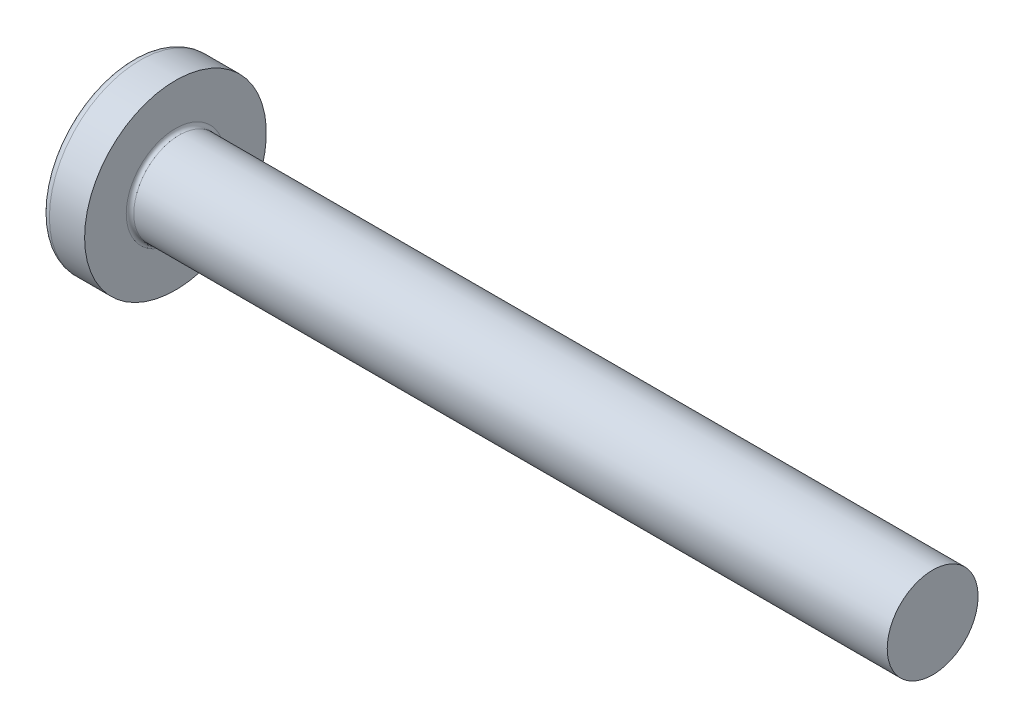
ISO-10303-21;
HEADER;
FILE_DESCRIPTION(('STEP AP214'),'2;1');
FILE_NAME('part.step','',(''),(''),'','','');
FILE_SCHEMA(('AUTOMOTIVE_DESIGN { 1 0 10303 214 1 1 1 1 }'));
ENDSEC;
DATA;
#1=APPLICATION_CONTEXT('core data for automotive mechanical design processes');
#2=APPLICATION_PROTOCOL_DEFINITION('international standard','automotive_design',2000,#1);
#3=PRODUCT_CONTEXT('',#1,'mechanical');
#4=PRODUCT('Part','Part','',(#3));
#5=PRODUCT_RELATED_PRODUCT_CATEGORY('part','',(#4));
#6=PRODUCT_DEFINITION_FORMATION('','',#4);
#7=PRODUCT_DEFINITION_CONTEXT('part definition',#1,'design');
#8=PRODUCT_DEFINITION('design','',#6,#7);
#9=PRODUCT_DEFINITION_SHAPE('','',#8);
#10=(LENGTH_UNIT() NAMED_UNIT(*) SI_UNIT(.MILLI.,.METRE.));
#11=(NAMED_UNIT(*) PLANE_ANGLE_UNIT() SI_UNIT($,.RADIAN.));
#12=(NAMED_UNIT(*) SI_UNIT($,.STERADIAN.) SOLID_ANGLE_UNIT());
#13=UNCERTAINTY_MEASURE_WITH_UNIT(LENGTH_MEASURE(1.E-05),#10,'distance_accuracy_value','');
#14=(GEOMETRIC_REPRESENTATION_CONTEXT(3) GLOBAL_UNCERTAINTY_ASSIGNED_CONTEXT((#13)) GLOBAL_UNIT_ASSIGNED_CONTEXT((#10,
#11,#12)) REPRESENTATION_CONTEXT('',''));
#15=CARTESIAN_POINT('',(0.,0.,0.));
#16=DIRECTION('',(0.,0.,1.));
#17=DIRECTION('',(1.,0.,0.));
#18=AXIS2_PLACEMENT_3D('',#15,#16,#17);
#19=CARTESIAN_POINT('',(3.46000000000024,0.,0.));
#20=DIRECTION('',(-1.,0.,0.));
#21=DIRECTION('',(0.,0.,1.));
#22=AXIS2_PLACEMENT_3D('',#19,#20,#21);
#23=CONICAL_SURFACE('',#22,1.28049999999957,1.25663706143548);
#24=CARTESIAN_POINT('',(3.8760596710265,0.,-3.33066907387547E-12));
#25=VERTEX_POINT('',#24);
#26=VERTEX_LOOP('',#25);
#27=FACE_BOUND('',#26,.T.);
#28=CARTESIAN_POINT('',(3.46000000000024,0.,0.));
#29=DIRECTION('',(-1.,0.,0.));
#30=DIRECTION('',(0.,0.,1.));
#31=AXIS2_PLACEMENT_3D('',#28,#29,#30);
#32=CIRCLE('',#31,1.28049999999957);
#33=CARTESIAN_POINT('',(3.46000000000017,-0.709999999999996,-1.06563607765555));
#34=VERTEX_POINT('',#33);
#35=CARTESIAN_POINT('',(3.46000000000012,0.710000000000004,-1.06563607765555));
#36=VERTEX_POINT('',#35);
#37=EDGE_CURVE('E142',#34,#36,#32,.F.);
#38=ORIENTED_EDGE('',*,*,#37,.F.);
#39=CARTESIAN_POINT('',(3.46000000000013,0.,0.));
#40=DIRECTION('',(-1.,0.,0.));
#41=DIRECTION('',(0.,0.,1.));
#42=AXIS2_PLACEMENT_3D('',#39,#40,#41);
#43=CIRCLE('',#42,1.28049999999957);
#44=CARTESIAN_POINT('',(3.46000000000012,-1.06563607765555,-0.710000000000001));
#45=VERTEX_POINT('',#44);
#46=EDGE_CURVE('E145',#45,#34,#43,.F.);
#47=ORIENTED_EDGE('',*,*,#46,.F.);
#48=CARTESIAN_POINT('',(3.46000000000024,0.,0.));
#49=DIRECTION('',(-1.,0.,0.));
#50=DIRECTION('',(0.,0.,1.));
#51=AXIS2_PLACEMENT_3D('',#48,#49,#50);
#52=CIRCLE('',#51,1.28049999999957);
#53=CARTESIAN_POINT('',(3.46000000000017,-1.06563607765554,0.71));
#54=VERTEX_POINT('',#53);
#55=EDGE_CURVE('E403',#54,#45,#52,.F.);
#56=ORIENTED_EDGE('',*,*,#55,.F.);
#57=CARTESIAN_POINT('',(3.46000000000013,0.,0.));
#58=DIRECTION('',(-1.,0.,0.));
#59=DIRECTION('',(0.,0.,1.));
#60=AXIS2_PLACEMENT_3D('',#57,#58,#59);
#61=CIRCLE('',#60,1.28049999999957);
#62=CARTESIAN_POINT('',(3.46000000000012,-0.710000000000004,1.06563607765555));
#63=VERTEX_POINT('',#62);
#64=EDGE_CURVE('E162',#63,#54,#61,.F.);
#65=ORIENTED_EDGE('',*,*,#64,.F.);
#66=CARTESIAN_POINT('',(3.46000000000024,0.,0.));
#67=DIRECTION('',(-1.,0.,0.));
#68=DIRECTION('',(0.,0.,1.));
#69=AXIS2_PLACEMENT_3D('',#66,#67,#68);
#70=CIRCLE('',#69,1.28049999999957);
#71=CARTESIAN_POINT('',(3.46000000000017,0.709999999999996,1.06563607765555));
#72=VERTEX_POINT('',#71);
#73=EDGE_CURVE('E413',#72,#63,#70,.F.);
#74=ORIENTED_EDGE('',*,*,#73,.F.);
#75=CARTESIAN_POINT('',(3.46000000000013,0.,0.));
#76=DIRECTION('',(-1.,0.,0.));
#77=DIRECTION('',(0.,0.,1.));
#78=AXIS2_PLACEMENT_3D('',#75,#76,#77);
#79=CIRCLE('',#78,1.28049999999957);
#80=CARTESIAN_POINT('',(3.46000000000012,1.06563607765555,0.710000000000001));
#81=VERTEX_POINT('',#80);
#82=EDGE_CURVE('E184',#81,#72,#79,.F.);
#83=ORIENTED_EDGE('',*,*,#82,.F.);
#84=CARTESIAN_POINT('',(3.46000000000024,0.,0.));
#85=DIRECTION('',(-1.,0.,0.));
#86=DIRECTION('',(0.,0.,1.));
#87=AXIS2_PLACEMENT_3D('',#84,#85,#86);
#88=CIRCLE('',#87,1.28049999999957);
#89=CARTESIAN_POINT('',(3.46000000000017,1.06563607765554,-0.71));
#90=VERTEX_POINT('',#89);
#91=EDGE_CURVE('E423',#90,#81,#88,.F.);
#92=ORIENTED_EDGE('',*,*,#91,.F.);
#93=CARTESIAN_POINT('',(3.46000000000013,0.,0.));
#94=DIRECTION('',(-1.,0.,0.));
#95=DIRECTION('',(0.,0.,1.));
#96=AXIS2_PLACEMENT_3D('',#93,#94,#95);
#97=CIRCLE('',#96,1.28049999999957);
#98=EDGE_CURVE('E139',#36,#90,#97,.F.);
#99=ORIENTED_EDGE('',*,*,#98,.F.);
#100=EDGE_LOOP('',(#38,#47,#56,#65,#74,#83,#92,#99));
#101=FACE_BOUND('',#100,.T.);
#102=ADVANCED_FACE('F18',(#27,#101),#23,.F.);
#103=CARTESIAN_POINT('',(3.46,1.6249076956596,-0.71));
#104=DIRECTION('',(-1.,0.,0.));
#105=DIRECTION('',(0.,0.,1.));
#106=AXIS2_PLACEMENT_3D('',#103,#104,#105);
#107=PLANE('',#106);
#108=DIRECTION('',(0.,0.,1.));
#109=VECTOR('',#108,1.);
#110=CARTESIAN_POINT('',(3.46,0.710000000000004,-0.71));
#111=LINE('',#110,#109);
#112=CARTESIAN_POINT('',(3.46,0.710000000000005,-1.6249076956596));
#113=VERTEX_POINT('',#112);
#114=EDGE_CURVE('E149',#36,#113,#111,.F.);
#115=ORIENTED_EDGE('',*,*,#114,.T.);
#116=DIRECTION('',(0.,1.,0.));
#117=VECTOR('',#116,1.);
#118=CARTESIAN_POINT('',(3.46,0.710000000000006,-1.6249076956596));
#119=LINE('',#118,#117);
#120=CARTESIAN_POINT('',(3.46,-0.709999999999994,-1.6249076956596));
#121=VERTEX_POINT('',#120);
#122=EDGE_CURVE('E175',#113,#121,#119,.F.);
#123=ORIENTED_EDGE('',*,*,#122,.T.);
#124=DIRECTION('',(0.,0.,1.));
#125=VECTOR('',#124,1.);
#126=CARTESIAN_POINT('',(3.46,-0.709999999999994,-0.71));
#127=LINE('',#126,#125);
#128=EDGE_CURVE('E150',#121,#34,#127,.T.);
#129=ORIENTED_EDGE('',*,*,#128,.T.);
#130=ORIENTED_EDGE('',*,*,#37,.T.);
#131=EDGE_LOOP('',(#115,#123,#129,#130));
#132=FACE_BOUND('',#131,.T.);
#133=ADVANCED_FACE('F173',(#132),#107,.T.);
#134=CARTESIAN_POINT('',(3.46,1.6249076956596,-0.71));
#135=DIRECTION('',(-1.,0.,0.));
#136=DIRECTION('',(0.,0.,1.));
#137=AXIS2_PLACEMENT_3D('',#134,#135,#136);
#138=PLANE('',#137);
#139=DIRECTION('',(0.,1.,0.));
#140=VECTOR('',#139,1.);
#141=CARTESIAN_POINT('',(3.46,1.6249076956596,0.710000000000001));
#142=LINE('',#141,#140);
#143=CARTESIAN_POINT('',(3.46,1.6249076956596,0.71));
#144=VERTEX_POINT('',#143);
#145=EDGE_CURVE('E419',#81,#144,#142,.T.);
#146=ORIENTED_EDGE('',*,*,#145,.T.);
#147=DIRECTION('',(0.,0.,1.));
#148=VECTOR('',#147,1.);
#149=CARTESIAN_POINT('',(3.46,1.6249076956596,0.71));
#150=LINE('',#149,#148);
#151=CARTESIAN_POINT('',(3.46,1.6249076956596,-0.71));
#152=VERTEX_POINT('',#151);
#153=EDGE_CURVE('E273',#144,#152,#150,.F.);
#154=ORIENTED_EDGE('',*,*,#153,.T.);
#155=DIRECTION('',(0.,1.,0.));
#156=VECTOR('',#155,1.);
#157=CARTESIAN_POINT('',(3.46,1.6249076956596,-0.71));
#158=LINE('',#157,#156);
#159=EDGE_CURVE('E426',#152,#90,#158,.F.);
#160=ORIENTED_EDGE('',*,*,#159,.T.);
#161=ORIENTED_EDGE('',*,*,#91,.T.);
#162=EDGE_LOOP('',(#146,#154,#160,#161));
#163=FACE_BOUND('',#162,.T.);
#164=ADVANCED_FACE('F702',(#163),#138,.T.);
#165=CARTESIAN_POINT('',(3.46,1.6249076956596,-0.71));
#166=DIRECTION('',(-1.,0.,0.));
#167=DIRECTION('',(0.,0.,1.));
#168=AXIS2_PLACEMENT_3D('',#165,#166,#167);
#169=PLANE('',#168);
#170=DIRECTION('',(0.,0.,1.));
#171=VECTOR('',#170,1.);
#172=CARTESIAN_POINT('',(3.46,-0.710000000000004,-0.71));
#173=LINE('',#172,#171);
#174=CARTESIAN_POINT('',(3.46,-0.710000000000005,1.6249076956596));
#175=VERTEX_POINT('',#174);
#176=EDGE_CURVE('E409',#63,#175,#173,.T.);
#177=ORIENTED_EDGE('',*,*,#176,.T.);
#178=DIRECTION('',(0.,1.,0.));
#179=VECTOR('',#178,1.);
#180=CARTESIAN_POINT('',(3.46,-0.710000000000005,1.6249076956596));
#181=LINE('',#180,#179);
#182=CARTESIAN_POINT('',(3.46,0.709999999999994,1.6249076956596));
#183=VERTEX_POINT('',#182);
#184=EDGE_CURVE('E268',#175,#183,#181,.T.);
#185=ORIENTED_EDGE('',*,*,#184,.T.);
#186=DIRECTION('',(0.,0.,1.));
#187=VECTOR('',#186,1.);
#188=CARTESIAN_POINT('',(3.46,0.709999999999994,-0.71));
#189=LINE('',#188,#187);
#190=EDGE_CURVE('E416',#183,#72,#189,.F.);
#191=ORIENTED_EDGE('',*,*,#190,.T.);
#192=ORIENTED_EDGE('',*,*,#73,.T.);
#193=EDGE_LOOP('',(#177,#185,#191,#192));
#194=FACE_BOUND('',#193,.T.);
#195=ADVANCED_FACE('F693',(#194),#169,.T.);
#196=CARTESIAN_POINT('',(3.46,1.6249076956596,-0.71));
#197=DIRECTION('',(-1.,0.,0.));
#198=DIRECTION('',(0.,0.,1.));
#199=AXIS2_PLACEMENT_3D('',#196,#197,#198);
#200=PLANE('',#199);
#201=DIRECTION('',(0.,1.,0.));
#202=VECTOR('',#201,1.);
#203=CARTESIAN_POINT('',(3.46,1.6249076956596,-0.710000000000001));
#204=LINE('',#203,#202);
#205=CARTESIAN_POINT('',(3.46,-1.6249076956596,-0.71));
#206=VERTEX_POINT('',#205);
#207=EDGE_CURVE('E400',#45,#206,#204,.F.);
#208=ORIENTED_EDGE('',*,*,#207,.T.);
#209=DIRECTION('',(0.,0.,1.));
#210=VECTOR('',#209,1.);
#211=CARTESIAN_POINT('',(3.46,-1.6249076956596,-0.71));
#212=LINE('',#211,#210);
#213=CARTESIAN_POINT('',(3.46,-1.6249076956596,0.71));
#214=VERTEX_POINT('',#213);
#215=EDGE_CURVE('E382',#206,#214,#212,.T.);
#216=ORIENTED_EDGE('',*,*,#215,.T.);
#217=DIRECTION('',(0.,1.,0.));
#218=VECTOR('',#217,1.);
#219=CARTESIAN_POINT('',(3.46,1.6249076956596,0.71));
#220=LINE('',#219,#218);
#221=EDGE_CURVE('E406',#214,#54,#220,.T.);
#222=ORIENTED_EDGE('',*,*,#221,.T.);
#223=ORIENTED_EDGE('',*,*,#55,.T.);
#224=EDGE_LOOP('',(#208,#216,#222,#223));
#225=FACE_BOUND('',#224,.T.);
#226=ADVANCED_FACE('F686',(#225),#200,.T.);
#227=CARTESIAN_POINT('',(0.11533271180042,0.,0.));
#228=DIRECTION('',(-1.,0.,0.));
#229=DIRECTION('',(0.,-1.,0.));
#230=AXIS2_PLACEMENT_3D('',#227,#228,#229);
#231=CONICAL_SURFACE('',#230,1.51438192047948,0.0698131700805599);
#232=CARTESIAN_POINT('',(0.115332711778448,-0.709999999999994,-1.33762947077275));
#233=CARTESIAN_POINT('',(0.585737959399698,-0.709999999999995,-1.30036826178023));
#234=CARTESIAN_POINT('',(1.05612001834101,-0.709999999999995,-1.26280489498165));
#235=CARTESIAN_POINT('',(1.9968105605958,-0.709999999999995,-1.18678547607953));
#236=CARTESIAN_POINT('',(2.46711904411431,-0.709999999999995,-1.14832942651));
#237=CARTESIAN_POINT('',(3.1115926018358,-0.709999999999996,-1.09481736096073));
#238=CARTESIAN_POINT('',(3.28579999567135,-0.709999999999996,-1.08027091626535));
#239=CARTESIAN_POINT('',(3.4600000000002,-0.709999999999996,-1.06563607765657));
#240=B_SPLINE_CURVE_WITH_KNOTS('',3,(#232,#233,#234,#235,#236,#237,#238,#239),.UNSPECIFIED.,.F.,
.F.,(4,2,2,4),(0.,1.41563717941876,2.83127034083983,3.35571127075106),.UNSPECIFIED.);
#241=CARTESIAN_POINT('',(0.115332711789434,-0.709999999999994,-1.33762947082067));
#242=VERTEX_POINT('',#241);
#243=EDGE_CURVE('E157',#242,#34,#240,.T.);
#244=ORIENTED_EDGE('',*,*,#243,.F.);
#245=CARTESIAN_POINT('',(0.11533271180042,0.,0.));
#246=DIRECTION('',(-1.,0.,0.));
#247=DIRECTION('',(0.,-1.,0.));
#248=AXIS2_PLACEMENT_3D('',#245,#246,#247);
#249=CIRCLE('',#248,1.51438192047948);
#250=CARTESIAN_POINT('',(0.115332711789433,-1.33762947077187,-0.71));
#251=VERTEX_POINT('',#250);
#252=EDGE_CURVE('E402',#251,#242,#249,.F.);
#253=ORIENTED_EDGE('',*,*,#252,.F.);
#254=CARTESIAN_POINT('',(3.4600000000002,-1.06563607765657,-0.71));
#255=CARTESIAN_POINT('',(3.0623980553913,-1.09903294576703,-0.71));
#256=CARTESIAN_POINT('',(2.66475823408025,-1.13197493896571,-0.71));
#257=CARTESIAN_POINT('',(1.86941857955645,-1.19711778708329,-0.71));
#258=CARTESIAN_POINT('',(1.47171874645664,-1.22931864338001,-0.71));
#259=CARTESIAN_POINT('',(0.914225882664661,-1.27405381121311,-0.71));
#260=CARTESIAN_POINT('',(0.754452035134685,-1.28682813942784,-0.71));
#261=CARTESIAN_POINT('',(0.434897404361311,-1.31229125657503,-0.71));
#262=CARTESIAN_POINT('',(0.275116621112865,-1.32498004544415,-0.71));
#263=CARTESIAN_POINT('',(0.115332711778446,-1.33762947077274,-0.71));
#264=B_SPLINE_CURVE_WITH_KNOTS('',3,(#254,#255,#256,#257,#258,#259,#260,#261,#262,#263),
.UNSPECIFIED.,.F.,.F.,(4,2,2,2,4),(0.,1.19700551447112,2.39400880344983,2.87485990602986,
3.35571136466683),.UNSPECIFIED.);
#265=EDGE_CURVE('E160',#45,#251,#264,.T.);
#266=ORIENTED_EDGE('',*,*,#265,.F.);
#267=ORIENTED_EDGE('',*,*,#46,.T.);
#268=EDGE_LOOP('',(#244,#253,#266,#267));
#269=FACE_BOUND('',#268,.T.);
#270=ADVANCED_FACE('F156',(#269),#231,.F.);
#271=CARTESIAN_POINT('',(3.46,0.710000000000006,-1.6249076956596));
#272=DIRECTION('',(0.446197800778958,0.,-0.89493436774996));
#273=DIRECTION('',(-0.89493436774996,0.,-0.446197800778958));
#274=AXIS2_PLACEMENT_3D('',#271,#272,#273);
#275=PLANE('',#274);
#276=ORIENTED_EDGE('',*,*,#122,.F.);
#277=DIRECTION('',(0.89493436774996,0.,0.446197800778958));
#278=VECTOR('',#277,1.);
#279=CARTESIAN_POINT('',(0.5166959565376,0.710000000000011,-3.09238490800381));
#280=LINE('',#279,#278);
#281=CARTESIAN_POINT('',(0.516695956537601,0.710000000000018,-3.09238490800381));
#282=VERTEX_POINT('',#281);
#283=EDGE_CURVE('E310',#282,#113,#280,.T.);
#284=ORIENTED_EDGE('',*,*,#283,.F.);
#285=CARTESIAN_POINT('',(0.516695956537604,-0.709999999999989,-3.09238490800381));
#286=CARTESIAN_POINT('',(0.501474669055727,-0.473333333333323,-3.09997396173131));
#287=CARTESIAN_POINT('',(0.493864025314788,-0.236666666666656,-3.10376848859506));
#288=CARTESIAN_POINT('',(0.493864025314786,0.236666666666677,-3.10376848859505));
#289=CARTESIAN_POINT('',(0.501474669055724,0.473333333333344,-3.0999739617313));
#290=CARTESIAN_POINT('',(0.516695956537599,0.71000000000001,-3.0923849080038));
#291=B_SPLINE_CURVE_WITH_KNOTS('',3,(#285,#286,#287,#288,#289,#290),.UNSPECIFIED.,.F.,.F.,(4,2,
4),(0.,0.710458220439767,1.42091644087953),.UNSPECIFIED.);
#292=CARTESIAN_POINT('',(0.516695956537602,-0.709999999999983,-3.09238490800381));
#293=VERTEX_POINT('',#292);
#294=EDGE_CURVE('E397',#293,#282,#291,.T.);
#295=ORIENTED_EDGE('',*,*,#294,.F.);
#296=DIRECTION('',(-0.89493436774996,0.,-0.446197800778958));
#297=VECTOR('',#296,1.);
#298=CARTESIAN_POINT('',(3.46,-0.709999999999994,-1.62490769565961));
#299=LINE('',#298,#297);
#300=EDGE_CURVE('E170',#121,#293,#299,.T.);
#301=ORIENTED_EDGE('',*,*,#300,.F.);
#302=EDGE_LOOP('',(#276,#284,#295,#301));
#303=FACE_BOUND('',#302,.T.);
#304=ADVANCED_FACE('F290',(#303),#275,.F.);
#305=CARTESIAN_POINT('',(0.11533271180042,0.,0.));
#306=DIRECTION('',(-1.,0.,0.));
#307=DIRECTION('',(0.,-1.,0.));
#308=AXIS2_PLACEMENT_3D('',#305,#306,#307);
#309=CONICAL_SURFACE('',#308,1.51438192047948,0.0698131700805599);
#310=CARTESIAN_POINT('',(3.4600000000002,0.710000000000004,-1.06563607765656));
#311=CARTESIAN_POINT('',(3.0623980553913,0.710000000000004,-1.09903294576703));
#312=CARTESIAN_POINT('',(2.66475823408025,0.710000000000004,-1.13197493896571));
#313=CARTESIAN_POINT('',(1.86941857955645,0.710000000000004,-1.19711778708329));
#314=CARTESIAN_POINT('',(1.47171874645664,0.710000000000004,-1.22931864338));
#315=CARTESIAN_POINT('',(0.914225882664661,0.710000000000004,-1.27405381121311));
#316=CARTESIAN_POINT('',(0.754452035134686,0.710000000000005,-1.28682813942784));
#317=CARTESIAN_POINT('',(0.434897404361313,0.710000000000005,-1.31229125657503));
#318=CARTESIAN_POINT('',(0.275116621112867,0.710000000000005,-1.32498004544415));
#319=CARTESIAN_POINT('',(0.115332711778448,0.710000000000005,-1.33762947077274));
#320=B_SPLINE_CURVE_WITH_KNOTS('',3,(#310,#311,#312,#313,#314,#315,#316,#317,#318,#319),
.UNSPECIFIED.,.F.,.F.,(4,2,2,2,4),(0.,1.19700551447112,2.39400880344983,2.87485990602985,
3.35571136466682),.UNSPECIFIED.);
#321=CARTESIAN_POINT('',(0.115332711789434,0.710000000000007,-1.33762947082066));
#322=VERTEX_POINT('',#321);
#323=EDGE_CURVE('E296',#36,#322,#320,.T.);
#324=ORIENTED_EDGE('',*,*,#323,.F.);
#325=ORIENTED_EDGE('',*,*,#98,.T.);
#326=CARTESIAN_POINT('',(0.115332711778447,1.33762947077274,-0.71));
#327=CARTESIAN_POINT('',(0.585737959399696,1.30036826178023,-0.71));
#328=CARTESIAN_POINT('',(1.05612001834101,1.26280489498164,-0.71));
#329=CARTESIAN_POINT('',(1.9968105605958,1.18678547607952,-0.71));
#330=CARTESIAN_POINT('',(2.46711904411431,1.14832942651,-0.71));
#331=CARTESIAN_POINT('',(3.1115926018358,1.09481736096073,-0.71));
#332=CARTESIAN_POINT('',(3.28579999567135,1.08027091626535,-0.71));
#333=CARTESIAN_POINT('',(3.4600000000002,1.06563607765657,-0.71));
#334=B_SPLINE_CURVE_WITH_KNOTS('',3,(#326,#327,#328,#329,#330,#331,#332,#333),.UNSPECIFIED.,.F.,
.F.,(4,2,2,4),(0.,1.41563717941876,2.83127034083983,3.35571127075106),.UNSPECIFIED.);
#335=CARTESIAN_POINT('',(0.115332711789433,1.33762947077187,-0.71));
#336=VERTEX_POINT('',#335);
#337=EDGE_CURVE('E302',#336,#90,#334,.T.);
#338=ORIENTED_EDGE('',*,*,#337,.F.);
#339=CARTESIAN_POINT('',(0.11533271180042,0.,0.));
#340=DIRECTION('',(-1.,0.,0.));
#341=DIRECTION('',(0.,-1.,0.));
#342=AXIS2_PLACEMENT_3D('',#339,#340,#341);
#343=CIRCLE('',#342,1.51438192047948);
#344=EDGE_CURVE('E279',#322,#336,#343,.F.);
#345=ORIENTED_EDGE('',*,*,#344,.F.);
#346=EDGE_LOOP('',(#324,#325,#338,#345));
#347=FACE_BOUND('',#346,.T.);
#348=ADVANCED_FACE('F285',(#347),#309,.F.);
#349=CARTESIAN_POINT('',(3.46,1.6249076956596,0.71));
#350=DIRECTION('',(0.446197800778958,0.89493436774996,0.));
#351=DIRECTION('',(-0.89493436774996,0.446197800778958,0.));
#352=AXIS2_PLACEMENT_3D('',#349,#350,#351);
#353=PLANE('',#352);
#354=ORIENTED_EDGE('',*,*,#153,.F.);
#355=DIRECTION('',(0.89493436774996,-0.446197800778958,0.));
#356=VECTOR('',#355,1.);
#357=CARTESIAN_POINT('',(0.516695956537605,3.09238490800381,0.71));
#358=LINE('',#357,#356);
#359=CARTESIAN_POINT('',(0.516695956537603,3.09238490800381,0.709999999999999));
#360=VERTEX_POINT('',#359);
#361=EDGE_CURVE('E362',#360,#144,#358,.T.);
#362=ORIENTED_EDGE('',*,*,#361,.F.);
#363=CARTESIAN_POINT('',(0.5166959565376,3.09238490800381,-0.710000000000001));
#364=CARTESIAN_POINT('',(0.501474669055724,3.0999739617313,-0.473333333333335));
#365=CARTESIAN_POINT('',(0.493864025314786,3.10376848859505,-0.236666666666668));
#366=CARTESIAN_POINT('',(0.49386402531479,3.10376848859506,0.236666666666668));
#367=CARTESIAN_POINT('',(0.501474669055732,3.09997396173131,0.473333333333338));
#368=CARTESIAN_POINT('',(0.516695956537612,3.09238490800383,0.710000000000007));
#369=B_SPLINE_CURVE_WITH_KNOTS('',3,(#363,#364,#365,#366,#367,#368),.UNSPECIFIED.,.F.,.F.,(4,2,
4),(0.,0.710458220439767,1.42091644087954),.UNSPECIFIED.);
#370=CARTESIAN_POINT('',(0.516695956537603,3.09238490800381,-0.710000000000001));
#371=VERTEX_POINT('',#370);
#372=EDGE_CURVE('E274',#371,#360,#369,.T.);
#373=ORIENTED_EDGE('',*,*,#372,.F.);
#374=DIRECTION('',(-0.89493436774996,0.446197800778958,0.));
#375=VECTOR('',#374,1.);
#376=CARTESIAN_POINT('',(3.46,1.6249076956596,-0.71));
#377=LINE('',#376,#375);
#378=EDGE_CURVE('E309',#152,#371,#377,.T.);
#379=ORIENTED_EDGE('',*,*,#378,.F.);
#380=EDGE_LOOP('',(#354,#362,#373,#379));
#381=FACE_BOUND('',#380,.T.);
#382=ADVANCED_FACE('F281',(#381),#353,.F.);
#383=CARTESIAN_POINT('',(0.11533271180042,0.,0.));
#384=DIRECTION('',(-1.,0.,0.));
#385=DIRECTION('',(0.,-1.,0.));
#386=AXIS2_PLACEMENT_3D('',#383,#384,#385);
#387=CONICAL_SURFACE('',#386,1.51438192047948,0.0698131700805599);
#388=CARTESIAN_POINT('',(0.115332711778449,0.709999999999995,1.33762947077275));
#389=CARTESIAN_POINT('',(0.585737959399696,0.709999999999995,1.30036826178023));
#390=CARTESIAN_POINT('',(1.05612001834101,0.709999999999996,1.26280489498165));
#391=CARTESIAN_POINT('',(1.9968105605958,0.709999999999996,1.18678547607953));
#392=CARTESIAN_POINT('',(2.46711904411431,0.709999999999996,1.14832942651));
#393=CARTESIAN_POINT('',(3.1115926018358,0.709999999999996,1.09481736096073));
#394=CARTESIAN_POINT('',(3.28579999567135,0.709999999999996,1.08027091626535));
#395=CARTESIAN_POINT('',(3.4600000000002,0.709999999999996,1.06563607765657));
#396=B_SPLINE_CURVE_WITH_KNOTS('',3,(#388,#389,#390,#391,#392,#393,#394,#395),.UNSPECIFIED.,.F.,
.F.,(4,2,2,4),(0.,1.41563717941876,2.83127034083983,3.35571127075106),.UNSPECIFIED.);
#397=CARTESIAN_POINT('',(0.115332711789435,0.709999999999995,1.33762947082066));
#398=VERTEX_POINT('',#397);
#399=EDGE_CURVE('E359',#398,#72,#396,.T.);
#400=ORIENTED_EDGE('',*,*,#399,.F.);
#401=CARTESIAN_POINT('',(0.11533271180042,0.,0.));
#402=DIRECTION('',(-1.,0.,0.));
#403=DIRECTION('',(0.,-1.,0.));
#404=AXIS2_PLACEMENT_3D('',#401,#402,#403);
#405=CIRCLE('',#404,1.51438192047948);
#406=CARTESIAN_POINT('',(0.115332711789433,1.33762947077187,0.71));
#407=VERTEX_POINT('',#406);
#408=EDGE_CURVE('E269',#407,#398,#405,.F.);
#409=ORIENTED_EDGE('',*,*,#408,.F.);
#410=CARTESIAN_POINT('',(3.4600000000002,1.06563607765657,0.71));
#411=CARTESIAN_POINT('',(3.0623980553913,1.09903294576703,0.71));
#412=CARTESIAN_POINT('',(2.66475823408025,1.13197493896571,0.71));
#413=CARTESIAN_POINT('',(1.86941857955645,1.19711778708329,0.71));
#414=CARTESIAN_POINT('',(1.47171874645664,1.22931864338001,0.71));
#415=CARTESIAN_POINT('',(0.914225882664661,1.27405381121312,0.71));
#416=CARTESIAN_POINT('',(0.754452035134686,1.28682813942784,0.71));
#417=CARTESIAN_POINT('',(0.434897404361312,1.31229125657503,0.71));
#418=CARTESIAN_POINT('',(0.275116621112866,1.32498004544415,0.709999999999999));
#419=CARTESIAN_POINT('',(0.115332711778447,1.33762947077274,0.709999999999999));
#420=B_SPLINE_CURVE_WITH_KNOTS('',3,(#410,#411,#412,#413,#414,#415,#416,#417,#418,#419),
.UNSPECIFIED.,.F.,.F.,(4,2,2,2,4),(0.,1.19700551447112,2.39400880344983,2.87485990602986,
3.35571136466683),.UNSPECIFIED.);
#421=EDGE_CURVE('E311',#81,#407,#420,.T.);
#422=ORIENTED_EDGE('',*,*,#421,.F.);
#423=ORIENTED_EDGE('',*,*,#82,.T.);
#424=EDGE_LOOP('',(#400,#409,#422,#423));
#425=FACE_BOUND('',#424,.T.);
#426=ADVANCED_FACE('F257',(#425),#387,.F.);
#427=CARTESIAN_POINT('',(3.46,-0.710000000000005,1.6249076956596));
#428=DIRECTION('',(0.446197800778958,0.,0.89493436774996));
#429=DIRECTION('',(0.89493436774996,0.,-0.446197800778958));
#430=AXIS2_PLACEMENT_3D('',#427,#428,#429);
#431=PLANE('',#430);
#432=ORIENTED_EDGE('',*,*,#184,.F.);
#433=DIRECTION('',(0.89493436774996,0.,-0.446197800778958));
#434=VECTOR('',#433,1.);
#435=CARTESIAN_POINT('',(0.516695956537604,-0.71000000000001,3.09238490800381));
#436=LINE('',#435,#434);
#437=CARTESIAN_POINT('',(0.5166959565376,-0.710000000000019,3.09238490800381));
#438=VERTEX_POINT('',#437);
#439=EDGE_CURVE('E232',#438,#175,#436,.T.);
#440=ORIENTED_EDGE('',*,*,#439,.F.);
#441=CARTESIAN_POINT('',(0.516695956537604,0.70999999999999,3.09238490800381));
#442=CARTESIAN_POINT('',(0.501474669055727,0.473333333333323,3.09997396173131));
#443=CARTESIAN_POINT('',(0.493864025314788,0.236666666666656,3.10376848859506));
#444=CARTESIAN_POINT('',(0.493864025314787,-0.236666666666677,3.10376848859505));
#445=CARTESIAN_POINT('',(0.501474669055724,-0.473333333333344,3.09997396173131));
#446=CARTESIAN_POINT('',(0.5166959565376,-0.710000000000011,3.09238490800381));
#447=B_SPLINE_CURVE_WITH_KNOTS('',3,(#441,#442,#443,#444,#445,#446),.UNSPECIFIED.,.F.,.F.,(4,2,
4),(0.,0.710458220439768,1.42091644087954),.UNSPECIFIED.);
#448=CARTESIAN_POINT('',(0.516695956537603,0.709999999999985,3.09238490800381));
#449=VERTEX_POINT('',#448);
#450=EDGE_CURVE('E262',#449,#438,#447,.T.);
#451=ORIENTED_EDGE('',*,*,#450,.F.);
#452=DIRECTION('',(-0.89493436774996,0.,0.446197800778958));
#453=VECTOR('',#452,1.);
#454=CARTESIAN_POINT('',(3.46,0.709999999999994,1.62490769565961));
#455=LINE('',#454,#453);
#456=EDGE_CURVE('E356',#183,#449,#455,.T.);
#457=ORIENTED_EDGE('',*,*,#456,.F.);
#458=EDGE_LOOP('',(#432,#440,#451,#457));
#459=FACE_BOUND('',#458,.T.);
#460=ADVANCED_FACE('F250',(#459),#431,.F.);
#461=CARTESIAN_POINT('',(0.11533271180042,0.,0.));
#462=DIRECTION('',(-1.,0.,0.));
#463=DIRECTION('',(0.,-1.,0.));
#464=AXIS2_PLACEMENT_3D('',#461,#462,#463);
#465=CONICAL_SURFACE('',#464,1.51438192047948,0.0698131700805599);
#466=CARTESIAN_POINT('',(3.4600000000002,-0.710000000000004,1.06563607765656));
#467=CARTESIAN_POINT('',(3.0623980553913,-0.710000000000004,1.09903294576703));
#468=CARTESIAN_POINT('',(2.66475823408025,-0.710000000000004,1.13197493896571));
#469=CARTESIAN_POINT('',(1.86941857955645,-0.710000000000004,1.19711778708329));
#470=CARTESIAN_POINT('',(1.47171874645664,-0.710000000000004,1.22931864338));
#471=CARTESIAN_POINT('',(0.914225882664661,-0.710000000000004,1.27405381121311));
#472=CARTESIAN_POINT('',(0.754452035134686,-0.710000000000004,1.28682813942784));
#473=CARTESIAN_POINT('',(0.434897404361312,-0.710000000000004,1.31229125657503));
#474=CARTESIAN_POINT('',(0.275116621112867,-0.710000000000004,1.32498004544415));
#475=CARTESIAN_POINT('',(0.115332711778447,-0.710000000000004,1.33762947077274));
#476=B_SPLINE_CURVE_WITH_KNOTS('',3,(#466,#467,#468,#469,#470,#471,#472,#473,#474,#475),
.UNSPECIFIED.,.F.,.F.,(4,2,2,2,4),(0.,1.19700551447112,2.39400880344983,2.87485990602986,
3.35571136466683),.UNSPECIFIED.);
#477=CARTESIAN_POINT('',(0.115332711789434,-0.710000000000008,1.33762947082066));
#478=VERTEX_POINT('',#477);
#479=EDGE_CURVE('E239',#63,#478,#476,.T.);
#480=ORIENTED_EDGE('',*,*,#479,.F.);
#481=ORIENTED_EDGE('',*,*,#64,.T.);
#482=CARTESIAN_POINT('',(0.115332711778446,-1.33762947077274,0.709999999999999));
#483=CARTESIAN_POINT('',(0.585737959399696,-1.30036826178023,0.709999999999999));
#484=CARTESIAN_POINT('',(1.05612001834101,-1.26280489498165,0.709999999999999));
#485=CARTESIAN_POINT('',(1.9968105605958,-1.18678547607952,0.71));
#486=CARTESIAN_POINT('',(2.46711904411431,-1.14832942651,0.71));
#487=CARTESIAN_POINT('',(3.1115926018358,-1.09481736096073,0.71));
#488=CARTESIAN_POINT('',(3.28579999567135,-1.08027091626535,0.71));
#489=CARTESIAN_POINT('',(3.4600000000002,-1.06563607765657,0.71));
#490=B_SPLINE_CURVE_WITH_KNOTS('',3,(#482,#483,#484,#485,#486,#487,#488,#489),.UNSPECIFIED.,.F.,
.F.,(4,2,2,4),(0.,1.41563717941876,2.83127034083983,3.35571127075106),.UNSPECIFIED.);
#491=CARTESIAN_POINT('',(0.115332711789433,-1.33762947077187,0.709999999999999));
#492=VERTEX_POINT('',#491);
#493=EDGE_CURVE('E223',#492,#54,#490,.T.);
#494=ORIENTED_EDGE('',*,*,#493,.F.);
#495=CARTESIAN_POINT('',(0.11533271180042,0.,0.));
#496=DIRECTION('',(-1.,0.,0.));
#497=DIRECTION('',(0.,-1.,0.));
#498=AXIS2_PLACEMENT_3D('',#495,#496,#497);
#499=CIRCLE('',#498,1.51438192047948);
#500=EDGE_CURVE('E270',#478,#492,#499,.F.);
#501=ORIENTED_EDGE('',*,*,#500,.F.);
#502=EDGE_LOOP('',(#480,#481,#494,#501));
#503=FACE_BOUND('',#502,.T.);
#504=ADVANCED_FACE('F244',(#503),#465,.F.);
#505=CARTESIAN_POINT('',(3.46,-1.6249076956596,-0.71));
#506=DIRECTION('',(0.446197800778958,-0.89493436774996,0.));
#507=DIRECTION('',(0.89493436774996,0.446197800778958,0.));
#508=AXIS2_PLACEMENT_3D('',#505,#506,#507);
#509=PLANE('',#508);
#510=ORIENTED_EDGE('',*,*,#215,.F.);
#511=DIRECTION('',(0.89493436774996,0.446197800778958,0.));
#512=VECTOR('',#511,1.);
#513=CARTESIAN_POINT('',(0.5166959565376,-3.09238490800381,-0.71));
#514=LINE('',#513,#512);
#515=CARTESIAN_POINT('',(0.516695956537598,-3.09238490800381,-0.710000000000001));
#516=VERTEX_POINT('',#515);
#517=EDGE_CURVE('E171',#516,#206,#514,.T.);
#518=ORIENTED_EDGE('',*,*,#517,.F.);
#519=CARTESIAN_POINT('',(0.516695956537596,-3.09238490800381,0.709999999999999));
#520=CARTESIAN_POINT('',(0.50147466905572,-3.0999739617313,0.473333333333332));
#521=CARTESIAN_POINT('',(0.493864025314783,-3.10376848859505,0.236666666666666));
#522=CARTESIAN_POINT('',(0.493864025314787,-3.10376848859506,-0.236666666666671));
#523=CARTESIAN_POINT('',(0.501474669055728,-3.09997396173132,-0.47333333333334));
#524=CARTESIAN_POINT('',(0.516695956537608,-3.09238490800383,-0.71000000000001));
#525=B_SPLINE_CURVE_WITH_KNOTS('',3,(#519,#520,#521,#522,#523,#524),.UNSPECIFIED.,.F.,.F.,(4,2,
4),(0.,0.710458220439767,1.42091644087954),.UNSPECIFIED.);
#526=CARTESIAN_POINT('',(0.516695956537598,-3.09238490800381,0.709999999999999));
#527=VERTEX_POINT('',#526);
#528=EDGE_CURVE('E385',#527,#516,#525,.T.);
#529=ORIENTED_EDGE('',*,*,#528,.F.);
#530=DIRECTION('',(-0.89493436774996,-0.446197800778958,0.));
#531=VECTOR('',#530,1.);
#532=CARTESIAN_POINT('',(3.46,-1.6249076956596,0.71));
#533=LINE('',#532,#531);
#534=EDGE_CURVE('E231',#214,#527,#533,.T.);
#535=ORIENTED_EDGE('',*,*,#534,.F.);
#536=EDGE_LOOP('',(#510,#518,#529,#535));
#537=FACE_BOUND('',#536,.T.);
#538=ADVANCED_FACE('F249',(#537),#509,.F.);
#539=CARTESIAN_POINT('',(3.46,1.6249076956596,-0.71));
#540=DIRECTION('',(0.,0.,1.));
#541=DIRECTION('',(1.,0.,0.));
#542=AXIS2_PLACEMENT_3D('',#539,#540,#541);
#543=PLANE('',#542);
#544=CARTESIAN_POINT('',(0.516695956537597,-3.09238490800381,-0.710000000000002));
#545=CARTESIAN_POINT('',(0.493370085866158,-3.02085281473148,-0.710000000000001));
#546=CARTESIAN_POINT('',(0.470853855491754,-2.94905671792699,-0.71));
#547=CARTESIAN_POINT('',(0.427484700069847,-2.805083537387,-0.71));
#548=CARTESIAN_POINT('',(0.406629286478297,-2.73290720327129,-0.71));
#549=CARTESIAN_POINT('',(0.366574860459565,-2.5881755089291,-0.71));
#550=CARTESIAN_POINT('',(0.347374182844379,-2.51562060953981,-0.71));
#551=CARTESIAN_POINT('',(0.310624604865499,-2.37013307902156,-0.71));
#552=CARTESIAN_POINT('',(0.293074866622178,-2.29720065953668,-0.71));
#553=CARTESIAN_POINT('',(0.259625059855846,-2.15095849346043,-0.71));
#554=CARTESIAN_POINT('',(0.243724991332835,-2.07764874686906,-0.710000000000001));
#555=CARTESIAN_POINT('',(0.21357490473758,-1.93065172208209,-0.709999999999999));
#556=CARTESIAN_POINT('',(0.199325733237866,-1.85696427024771,-0.709999999999998));
#557=CARTESIAN_POINT('',(0.172480460769207,-1.70921126101631,-0.710000000000002));
#558=CARTESIAN_POINT('',(0.159886059748319,-1.63514539475268,-0.710000000000009));
#559=CARTESIAN_POINT('',(0.136355664251268,-1.48663451688657,-0.709999999999991));
#560=CARTESIAN_POINT('',(0.12542223674949,-1.41218909856081,-0.709999999999967));
#561=CARTESIAN_POINT('',(0.115332711773903,-1.33762947077024,-0.709999999999907));
#562=B_SPLINE_CURVE_WITH_KNOTS('',3,(#544,#545,#546,#547,#548,#549,#550,#551,#552,#553,#554,
#555,#556,#557,#558,#559,#560,#561),.UNSPECIFIED.,.F.,.F.,(4,2,2,2,2,2,2,2,4),(0.,
0.225712752763147,0.451080675321654,0.676219091704167,0.901242623033032,1.1262661543619,
1.35140457074441,1.57677249330292,1.80248524606606),.UNSPECIFIED.);
#563=EDGE_CURVE('E233',#516,#251,#562,.T.);
#564=ORIENTED_EDGE('',*,*,#563,.F.);
#565=ORIENTED_EDGE('',*,*,#517,.T.);
#566=ORIENTED_EDGE('',*,*,#207,.F.);
#567=ORIENTED_EDGE('',*,*,#265,.T.);
#568=EDGE_LOOP('',(#564,#565,#566,#567));
#569=FACE_BOUND('',#568,.T.);
#570=ADVANCED_FACE('F632',(#569),#543,.T.);
#571=CARTESIAN_POINT('',(3.46,-0.709999999999994,-1.62490769565961));
#572=DIRECTION('',(0.,1.,0.));
#573=DIRECTION('',(0.,0.,1.));
#574=AXIS2_PLACEMENT_3D('',#571,#572,#573);
#575=PLANE('',#574);
#576=ORIENTED_EDGE('',*,*,#128,.F.);
#577=ORIENTED_EDGE('',*,*,#300,.T.);
#578=CARTESIAN_POINT('',(10.,-0.709999999999994,0.));
#579=DIRECTION('',(0.,1.,0.));
#580=DIRECTION('',(0.,0.,1.));
#581=AXIS2_PLACEMENT_3D('',#578,#579,#580);
#582=CIRCLE('',#581,9.97476315508294);
#583=EDGE_CURVE('E169',#242,#293,#582,.F.);
#584=ORIENTED_EDGE('',*,*,#583,.F.);
#585=ORIENTED_EDGE('',*,*,#243,.T.);
#586=EDGE_LOOP('',(#576,#577,#584,#585));
#587=FACE_BOUND('',#586,.T.);
#588=ADVANCED_FACE('F165',(#587),#575,.T.);
#589=CARTESIAN_POINT('',(3.46,0.709999999999994,1.62490769565961));
#590=DIRECTION('',(0.,-1.,0.));
#591=DIRECTION('',(0.,0.,-1.));
#592=AXIS2_PLACEMENT_3D('',#589,#590,#591);
#593=PLANE('',#592);
#594=CARTESIAN_POINT('',(10.,0.71000000000001,0.));
#595=DIRECTION('',(0.,1.,0.));
#596=DIRECTION('',(0.,0.,1.));
#597=AXIS2_PLACEMENT_3D('',#594,#595,#596);
#598=CIRCLE('',#597,9.97476315508293);
#599=EDGE_CURVE('E335',#282,#322,#598,.T.);
#600=ORIENTED_EDGE('',*,*,#599,.F.);
#601=ORIENTED_EDGE('',*,*,#283,.T.);
#602=ORIENTED_EDGE('',*,*,#114,.F.);
#603=ORIENTED_EDGE('',*,*,#323,.T.);
#604=EDGE_LOOP('',(#600,#601,#602,#603));
#605=FACE_BOUND('',#604,.T.);
#606=ADVANCED_FACE('F320',(#605),#593,.T.);
#607=CARTESIAN_POINT('',(3.46,1.6249076956596,-0.71));
#608=DIRECTION('',(0.,0.,1.));
#609=DIRECTION('',(1.,0.,0.));
#610=AXIS2_PLACEMENT_3D('',#607,#608,#609);
#611=PLANE('',#610);
#612=ORIENTED_EDGE('',*,*,#159,.F.);
#613=ORIENTED_EDGE('',*,*,#378,.T.);
#614=CARTESIAN_POINT('',(0.115332711773889,1.33762947077009,-0.71));
#615=CARTESIAN_POINT('',(0.125422236749469,1.41218909856068,-0.71));
#616=CARTESIAN_POINT('',(0.136355664251246,1.48663451688644,-0.71));
#617=CARTESIAN_POINT('',(0.159886059748297,1.63514539475256,-0.71));
#618=CARTESIAN_POINT('',(0.172480460769188,1.7092112610162,-0.71));
#619=CARTESIAN_POINT('',(0.199325733237849,1.85696427024761,-0.71));
#620=CARTESIAN_POINT('',(0.213574904737562,1.930651722082,-0.71));
#621=CARTESIAN_POINT('',(0.243724991332817,2.07764874686898,-0.71));
#622=CARTESIAN_POINT('',(0.259625059855828,2.15095849346036,-0.71));
#623=CARTESIAN_POINT('',(0.293074866622162,2.29720065953662,-0.71));
#624=CARTESIAN_POINT('',(0.310624604865486,2.3701330790215,-0.71));
#625=CARTESIAN_POINT('',(0.34737418284437,2.51562060953976,-0.71));
#626=CARTESIAN_POINT('',(0.366574860459558,2.58817550892906,-0.71));
#627=CARTESIAN_POINT('',(0.406629286478292,2.73290720327125,-0.71));
#628=CARTESIAN_POINT('',(0.427484700069843,2.80508353738697,-0.71));
#629=CARTESIAN_POINT('',(0.470853855491752,2.94905671792697,-0.71));
#630=CARTESIAN_POINT('',(0.493370085866158,3.02085281473147,-0.71));
#631=CARTESIAN_POINT('',(0.5166959565376,3.09238490800381,-0.710000000000001));
#632=B_SPLINE_CURVE_WITH_KNOTS('',3,(#614,#615,#616,#617,#618,#619,#620,#621,#622,#623,#624,
#625,#626,#627,#628,#629,#630,#631),.UNSPECIFIED.,.F.,.F.,(4,2,2,2,2,2,2,2,4),(0.,
0.225712752763166,0.451080675321691,0.676219091704222,0.901242623033104,1.12626615436199,
1.35140457074452,1.57677249330304,1.80248524606621),.UNSPECIFIED.);
#633=EDGE_CURVE('E327',#336,#371,#632,.T.);
#634=ORIENTED_EDGE('',*,*,#633,.F.);
#635=ORIENTED_EDGE('',*,*,#337,.T.);
#636=EDGE_LOOP('',(#612,#613,#634,#635));
#637=FACE_BOUND('',#636,.T.);
#638=ADVANCED_FACE('F316',(#637),#611,.T.);
#639=CARTESIAN_POINT('',(3.46,-1.6249076956596,0.71));
#640=DIRECTION('',(0.,0.,-1.));
#641=DIRECTION('',(-1.,0.,0.));
#642=AXIS2_PLACEMENT_3D('',#639,#640,#641);
#643=PLANE('',#642);
#644=CARTESIAN_POINT('',(0.5166959565376,3.09238490800381,0.709999999999999));
#645=CARTESIAN_POINT('',(0.493370085866162,3.02085281473148,0.709999999999999));
#646=CARTESIAN_POINT('',(0.470853855491757,2.94905671792699,0.71));
#647=CARTESIAN_POINT('',(0.427484700069849,2.80508353738699,0.71));
#648=CARTESIAN_POINT('',(0.406629286478298,2.73290720327128,0.71));
#649=CARTESIAN_POINT('',(0.366574860459566,2.5881755089291,0.71));
#650=CARTESIAN_POINT('',(0.347374182844381,2.5156206095398,0.71));
#651=CARTESIAN_POINT('',(0.3106246048655,2.37013307902156,0.71));
#652=CARTESIAN_POINT('',(0.293074866622178,2.29720065953668,0.709999999999999));
#653=CARTESIAN_POINT('',(0.259625059855845,2.15095849346043,0.71));
#654=CARTESIAN_POINT('',(0.243724991332835,2.07764874686906,0.71));
#655=CARTESIAN_POINT('',(0.21357490473758,1.93065172208209,0.709999999999999));
#656=CARTESIAN_POINT('',(0.199325733237866,1.8569642702477,0.709999999999997));
#657=CARTESIAN_POINT('',(0.172480460769206,1.70921126101631,0.710000000000002));
#658=CARTESIAN_POINT('',(0.159886059748316,1.63514539475267,0.710000000000009));
#659=CARTESIAN_POINT('',(0.136355664251264,1.48663451688656,0.70999999999999));
#660=CARTESIAN_POINT('',(0.125422236749486,1.41218909856081,0.709999999999965));
#661=CARTESIAN_POINT('',(0.115332711773903,1.33762947077023,0.709999999999904));
#662=B_SPLINE_CURVE_WITH_KNOTS('',3,(#644,#645,#646,#647,#648,#649,#650,#651,#652,#653,#654,
#655,#656,#657,#658,#659,#660,#661),.UNSPECIFIED.,.F.,.F.,(4,2,2,2,2,2,2,2,4),(0.,
0.225712752763148,0.451080675321656,0.676219091704169,0.901242623033036,1.1262661543619,
1.35140457074442,1.57677249330292,1.80248524606607),.UNSPECIFIED.);
#663=EDGE_CURVE('E334',#360,#407,#662,.T.);
#664=ORIENTED_EDGE('',*,*,#663,.F.);
#665=ORIENTED_EDGE('',*,*,#361,.T.);
#666=ORIENTED_EDGE('',*,*,#145,.F.);
#667=ORIENTED_EDGE('',*,*,#421,.T.);
#668=EDGE_LOOP('',(#664,#665,#666,#667));
#669=FACE_BOUND('',#668,.T.);
#670=ADVANCED_FACE('F319',(#669),#643,.T.);
#671=CARTESIAN_POINT('',(3.46,0.709999999999994,1.62490769565961));
#672=DIRECTION('',(0.,-1.,0.));
#673=DIRECTION('',(0.,0.,-1.));
#674=AXIS2_PLACEMENT_3D('',#671,#672,#673);
#675=PLANE('',#674);
#676=ORIENTED_EDGE('',*,*,#190,.F.);
#677=ORIENTED_EDGE('',*,*,#456,.T.);
#678=CARTESIAN_POINT('',(10.,0.709999999999995,0.));
#679=DIRECTION('',(0.,1.,0.));
#680=DIRECTION('',(0.,0.,1.));
#681=AXIS2_PLACEMENT_3D('',#678,#679,#680);
#682=CIRCLE('',#681,9.97476315508293);
#683=EDGE_CURVE('E783',#398,#449,#682,.T.);
#684=ORIENTED_EDGE('',*,*,#683,.F.);
#685=ORIENTED_EDGE('',*,*,#399,.T.);
#686=EDGE_LOOP('',(#676,#677,#684,#685));
#687=FACE_BOUND('',#686,.T.);
#688=ADVANCED_FACE('F599',(#687),#675,.T.);
#689=CARTESIAN_POINT('',(3.46,-0.709999999999994,-1.62490769565961));
#690=DIRECTION('',(0.,1.,0.));
#691=DIRECTION('',(0.,0.,1.));
#692=AXIS2_PLACEMENT_3D('',#689,#690,#691);
#693=PLANE('',#692);
#694=CARTESIAN_POINT('',(10.,-0.710000000000011,0.));
#695=DIRECTION('',(0.,1.,0.));
#696=DIRECTION('',(0.,0.,1.));
#697=AXIS2_PLACEMENT_3D('',#694,#695,#696);
#698=CIRCLE('',#697,9.97476315508293);
#699=EDGE_CURVE('E207',#438,#478,#698,.F.);
#700=ORIENTED_EDGE('',*,*,#699,.F.);
#701=ORIENTED_EDGE('',*,*,#439,.T.);
#702=ORIENTED_EDGE('',*,*,#176,.F.);
#703=ORIENTED_EDGE('',*,*,#479,.T.);
#704=EDGE_LOOP('',(#700,#701,#702,#703));
#705=FACE_BOUND('',#704,.T.);
#706=ADVANCED_FACE('F217',(#705),#693,.T.);
#707=CARTESIAN_POINT('',(3.46,-1.6249076956596,0.71));
#708=DIRECTION('',(0.,0.,-1.));
#709=DIRECTION('',(-1.,0.,0.));
#710=AXIS2_PLACEMENT_3D('',#707,#708,#709);
#711=PLANE('',#710);
#712=ORIENTED_EDGE('',*,*,#221,.F.);
#713=ORIENTED_EDGE('',*,*,#534,.T.);
#714=CARTESIAN_POINT('',(0.115332711773889,-1.3376294707701,0.709999999999997));
#715=CARTESIAN_POINT('',(0.125422236749467,-1.41218909856068,0.709999999999998));
#716=CARTESIAN_POINT('',(0.136355664251245,-1.48663451688644,0.709999999999999));
#717=CARTESIAN_POINT('',(0.159886059748296,-1.63514539475257,0.709999999999999));
#718=CARTESIAN_POINT('',(0.172480460769188,-1.70921126101621,0.709999999999999));
#719=CARTESIAN_POINT('',(0.199325733237849,-1.85696427024761,0.709999999999999));
#720=CARTESIAN_POINT('',(0.213574904737562,-1.930651722082,0.709999999999999));
#721=CARTESIAN_POINT('',(0.243724991332816,-2.07764874686898,0.709999999999999));
#722=CARTESIAN_POINT('',(0.259625059855826,-2.15095849346036,0.709999999999999));
#723=CARTESIAN_POINT('',(0.293074866622161,-2.29720065953662,0.709999999999999));
#724=CARTESIAN_POINT('',(0.310624604865486,-2.37013307902151,0.709999999999999));
#725=CARTESIAN_POINT('',(0.34737418284437,-2.51562060953976,0.709999999999999));
#726=CARTESIAN_POINT('',(0.366574860459556,-2.58817550892906,0.709999999999999));
#727=CARTESIAN_POINT('',(0.406629286478288,-2.73290720327126,0.709999999999999));
#728=CARTESIAN_POINT('',(0.427484700069838,-2.80508353738697,0.709999999999999));
#729=CARTESIAN_POINT('',(0.470853855491747,-2.94905671792698,0.709999999999999));
#730=CARTESIAN_POINT('',(0.493370085866154,-3.02085281473148,0.709999999999999));
#731=CARTESIAN_POINT('',(0.516695956537597,-3.09238490800381,0.709999999999999));
#732=B_SPLINE_CURVE_WITH_KNOTS('',3,(#714,#715,#716,#717,#718,#719,#720,#721,#722,#723,#724,
#725,#726,#727,#728,#729,#730,#731),.UNSPECIFIED.,.F.,.F.,(4,2,2,2,2,2,2,2,4),(0.,
0.225712752763165,0.451080675321688,0.676219091704218,0.901242623033101,1.12626615436198,
1.35140457074451,1.57677249330304,1.8024852460662),.UNSPECIFIED.);
#733=EDGE_CURVE('E199',#492,#527,#732,.T.);
#734=ORIENTED_EDGE('',*,*,#733,.F.);
#735=ORIENTED_EDGE('',*,*,#493,.T.);
#736=EDGE_LOOP('',(#712,#713,#734,#735));
#737=FACE_BOUND('',#736,.T.);
#738=ADVANCED_FACE('F213',(#737),#711,.T.);
#739=CARTESIAN_POINT('',(10.,0.,0.));
#740=DIRECTION('',(0.,1.,0.));
#741=DIRECTION('',(1.,0.,0.));
#742=AXIS2_PLACEMENT_3D('',#739,#740,#741);
#743=SPHERICAL_SURFACE('',#742,10.);
#744=CARTESIAN_POINT('',(1.83373872480848,0.,0.));
#745=DIRECTION('',(-1.,0.,0.));
#746=DIRECTION('',(0.,0.,1.));
#747=AXIS2_PLACEMENT_3D('',#744,#745,#746);
#748=CIRCLE('',#747,5.77167019027484);
#749=CARTESIAN_POINT('',(1.83373872480848,0.,5.77167019027484));
#750=VERTEX_POINT('',#749);
#751=EDGE_CURVE('E196',#750,#750,#748,.F.);
#752=ORIENTED_EDGE('',*,*,#751,.F.);
#753=EDGE_LOOP('',(#752));
#754=FACE_BOUND('',#753,.T.);
#755=ORIENTED_EDGE('',*,*,#733,.T.);
#756=ORIENTED_EDGE('',*,*,#528,.T.);
#757=ORIENTED_EDGE('',*,*,#563,.T.);
#758=ORIENTED_EDGE('',*,*,#252,.T.);
#759=ORIENTED_EDGE('',*,*,#583,.T.);
#760=ORIENTED_EDGE('',*,*,#294,.T.);
#761=ORIENTED_EDGE('',*,*,#599,.T.);
#762=ORIENTED_EDGE('',*,*,#344,.T.);
#763=ORIENTED_EDGE('',*,*,#633,.T.);
#764=ORIENTED_EDGE('',*,*,#372,.T.);
#765=ORIENTED_EDGE('',*,*,#663,.T.);
#766=ORIENTED_EDGE('',*,*,#408,.T.);
#767=ORIENTED_EDGE('',*,*,#683,.T.);
#768=ORIENTED_EDGE('',*,*,#450,.T.);
#769=ORIENTED_EDGE('',*,*,#699,.T.);
#770=ORIENTED_EDGE('',*,*,#500,.T.);
#771=EDGE_LOOP('',(#755,#756,#757,#758,#759,#760,#761,#762,#763,#764,#765,#766,#767,#768,#769,#770));
#772=FACE_BOUND('',#771,.T.);
#773=ADVANCED_FACE('F209',(#754,#772),#743,.T.);
#774=CARTESIAN_POINT('',(2.27471683366882,0.,0.));
#775=DIRECTION('',(-1.,0.,0.));
#776=DIRECTION('',(0.,0.,1.));
#777=AXIS2_PLACEMENT_3D('',#774,#775,#776);
#778=TOROIDAL_SURFACE('',#777,5.46,0.54);
#779=ORIENTED_EDGE('',*,*,#751,.T.);
#780=EDGE_LOOP('',(#779));
#781=FACE_BOUND('',#780,.T.);
#782=CARTESIAN_POINT('',(2.27471683366882,0.,0.));
#783=DIRECTION('',(-1.,0.,0.));
#784=DIRECTION('',(0.,0.,1.));
#785=AXIS2_PLACEMENT_3D('',#782,#783,#784);
#786=CIRCLE('',#785,6.);
#787=CARTESIAN_POINT('',(2.27471683366882,0.,6.));
#788=VERTEX_POINT('',#787);
#789=EDGE_CURVE('E195',#788,#788,#786,.F.);
#790=ORIENTED_EDGE('',*,*,#789,.F.);
#791=EDGE_LOOP('',(#790));
#792=FACE_BOUND('',#791,.T.);
#793=ADVANCED_FACE('F572',(#781,#792),#778,.T.);
#794=CARTESIAN_POINT('',(-25.4,0.,0.));
#795=DIRECTION('',(-1.,0.,0.));
#796=DIRECTION('',(0.,0.,1.));
#797=AXIS2_PLACEMENT_3D('',#794,#795,#796);
#798=CYLINDRICAL_SURFACE('',#797,6.);
#799=ORIENTED_EDGE('',*,*,#789,.T.);
#800=EDGE_LOOP('',(#799));
#801=FACE_BOUND('',#800,.T.);
#802=CARTESIAN_POINT('',(4.6,0.,0.));
#803=DIRECTION('',(-1.,0.,0.));
#804=DIRECTION('',(0.,0.,1.));
#805=AXIS2_PLACEMENT_3D('',#802,#803,#804);
#806=CIRCLE('',#805,6.);
#807=CARTESIAN_POINT('',(4.6,0.,6.));
#808=VERTEX_POINT('',#807);
#809=EDGE_CURVE('E191',#808,#808,#806,.T.);
#810=ORIENTED_EDGE('',*,*,#809,.T.);
#811=EDGE_LOOP('',(#810));
#812=FACE_BOUND('',#811,.T.);
#813=ADVANCED_FACE('F469',(#801,#812),#798,.T.);
#814=CARTESIAN_POINT('',(4.6,3.,0.));
#815=DIRECTION('',(-1.,0.,0.));
#816=DIRECTION('',(0.,0.,1.));
#817=AXIS2_PLACEMENT_3D('',#814,#815,#816);
#818=PLANE('',#817);
#819=ORIENTED_EDGE('',*,*,#809,.F.);
#820=EDGE_LOOP('',(#819));
#821=FACE_BOUND('',#820,.T.);
#822=CARTESIAN_POINT('',(4.6,0.,0.));
#823=DIRECTION('',(1.,0.,0.));
#824=DIRECTION('',(0.,0.,1.));
#825=AXIS2_PLACEMENT_3D('',#822,#823,#824);
#826=CIRCLE('',#825,3.25);
#827=CARTESIAN_POINT('',(4.6,0.,-3.25));
#828=VERTEX_POINT('',#827);
#829=CARTESIAN_POINT('',(4.6,0.,3.25));
#830=VERTEX_POINT('',#829);
#831=EDGE_CURVE('E194',#828,#830,#826,.F.);
#832=ORIENTED_EDGE('',*,*,#831,.T.);
#833=CARTESIAN_POINT('',(4.6,0.,0.));
#834=DIRECTION('',(1.,0.,0.));
#835=DIRECTION('',(0.,0.,-1.));
#836=AXIS2_PLACEMENT_3D('',#833,#834,#835);
#837=CIRCLE('',#836,3.25);
#838=EDGE_CURVE('E37',#830,#828,#837,.F.);
#839=ORIENTED_EDGE('',*,*,#838,.T.);
#840=EDGE_LOOP('',(#832,#839));
#841=FACE_BOUND('',#840,.T.);
#842=ADVANCED_FACE('F451',(#821,#841),#818,.F.);
#843=CARTESIAN_POINT('',(54.6,3.,0.));
#844=DIRECTION('',(1.,0.,0.));
#845=DIRECTION('',(0.,0.,-1.));
#846=AXIS2_PLACEMENT_3D('',#843,#844,#845);
#847=PLANE('',#846);
#848=CARTESIAN_POINT('',(54.6,0.,0.));
#849=DIRECTION('',(-1.,0.,0.));
#850=DIRECTION('',(0.,0.,1.));
#851=AXIS2_PLACEMENT_3D('',#848,#849,#850);
#852=CIRCLE('',#851,3.);
#853=CARTESIAN_POINT('',(54.6,0.,3.));
#854=VERTEX_POINT('',#853);
#855=EDGE_CURVE('E29',#854,#854,#852,.T.);
#856=ORIENTED_EDGE('',*,*,#855,.F.);
#857=EDGE_LOOP('',(#856));
#858=FACE_BOUND('',#857,.T.);
#859=ADVANCED_FACE('F468',(#858),#847,.T.);
#860=CARTESIAN_POINT('',(4.85,0.,0.));
#861=DIRECTION('',(-1.,0.,0.));
#862=DIRECTION('',(0.,0.,1.));
#863=AXIS2_PLACEMENT_3D('',#860,#861,#862);
#864=TOROIDAL_SURFACE('',#863,3.25,0.25);
#865=ORIENTED_EDGE('',*,*,#838,.F.);
#866=ORIENTED_EDGE('',*,*,#831,.F.);
#867=EDGE_LOOP('',(#865,#866));
#868=FACE_BOUND('',#867,.T.);
#869=CARTESIAN_POINT('',(4.85,0.,0.));
#870=DIRECTION('',(-1.,0.,0.));
#871=DIRECTION('',(0.,0.,1.));
#872=AXIS2_PLACEMENT_3D('',#869,#870,#871);
#873=CIRCLE('',#872,3.);
#874=CARTESIAN_POINT('',(4.85,0.,3.));
#875=VERTEX_POINT('',#874);
#876=EDGE_CURVE('E11',#875,#875,#873,.F.);
#877=ORIENTED_EDGE('',*,*,#876,.F.);
#878=EDGE_LOOP('',(#877));
#879=FACE_BOUND('',#878,.T.);
#880=ADVANCED_FACE('F447',(#868,#879),#864,.F.);
#881=CARTESIAN_POINT('',(-25.4,0.,0.));
#882=DIRECTION('',(-1.,0.,0.));
#883=DIRECTION('',(0.,0.,1.));
#884=AXIS2_PLACEMENT_3D('',#881,#882,#883);
#885=CYLINDRICAL_SURFACE('',#884,3.);
#886=ORIENTED_EDGE('',*,*,#876,.T.);
#887=EDGE_LOOP('',(#886));
#888=FACE_BOUND('',#887,.T.);
#889=ORIENTED_EDGE('',*,*,#855,.T.);
#890=EDGE_LOOP('',(#889));
#891=FACE_BOUND('',#890,.T.);
#892=ADVANCED_FACE('F491',(#888,#891),#885,.T.);
#893=CLOSED_SHELL('',(#102,#133,#164,#195,#226,#270,#304,#348,#382,#426,#460,#504,#538,#570,
#588,#606,#638,#670,#688,#706,#738,#773,#793,#813,#842,#859,#880,#892));
#894=MANIFOLD_SOLID_BREP('B1',#893);
#895=ADVANCED_BREP_SHAPE_REPRESENTATION('',(#18,#894),#14);
#896=SHAPE_DEFINITION_REPRESENTATION(#9,#895);
ENDSEC;
END-ISO-10303-21;
